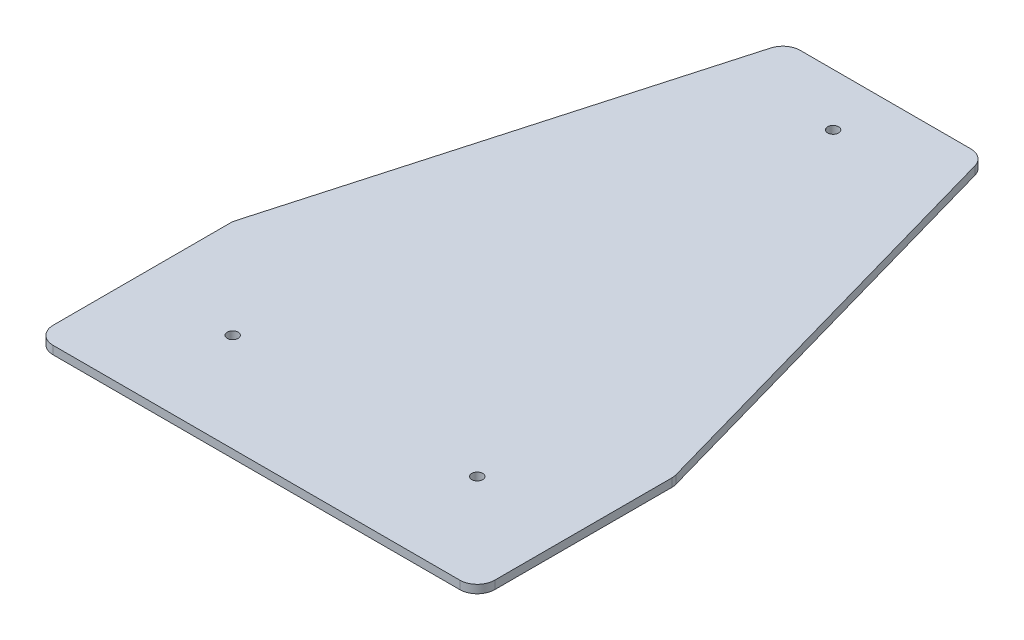
ISO-10303-21;
HEADER;
FILE_DESCRIPTION(('STEP AP214'),'2;1');
FILE_NAME('part.step','',(''),(''),'','','');
FILE_SCHEMA(('AUTOMOTIVE_DESIGN { 1 0 10303 214 1 1 1 1 }'));
ENDSEC;
DATA;
#1=APPLICATION_CONTEXT('core data for automotive mechanical design processes');
#2=APPLICATION_PROTOCOL_DEFINITION('international standard','automotive_design',2000,#1);
#3=PRODUCT_CONTEXT('',#1,'mechanical');
#4=PRODUCT('Part','Part','',(#3));
#5=PRODUCT_RELATED_PRODUCT_CATEGORY('part','',(#4));
#6=PRODUCT_DEFINITION_FORMATION('','',#4);
#7=PRODUCT_DEFINITION_CONTEXT('part definition',#1,'design');
#8=PRODUCT_DEFINITION('design','',#6,#7);
#9=PRODUCT_DEFINITION_SHAPE('','',#8);
#10=(LENGTH_UNIT() NAMED_UNIT(*) SI_UNIT(.MILLI.,.METRE.));
#11=(NAMED_UNIT(*) PLANE_ANGLE_UNIT() SI_UNIT($,.RADIAN.));
#12=(NAMED_UNIT(*) SI_UNIT($,.STERADIAN.) SOLID_ANGLE_UNIT());
#13=UNCERTAINTY_MEASURE_WITH_UNIT(LENGTH_MEASURE(1.E-05),#10,'distance_accuracy_value','');
#14=(GEOMETRIC_REPRESENTATION_CONTEXT(3) GLOBAL_UNCERTAINTY_ASSIGNED_CONTEXT((#13)) GLOBAL_UNIT_ASSIGNED_CONTEXT((#10,
#11,#12)) REPRESENTATION_CONTEXT('',''));
#15=CARTESIAN_POINT('',(0.,0.,0.));
#16=DIRECTION('',(0.,0.,1.));
#17=DIRECTION('',(1.,0.,0.));
#18=AXIS2_PLACEMENT_3D('',#15,#16,#17);
#19=CARTESIAN_POINT('',(28.18,2.36,-151.82));
#20=DIRECTION('',(-0.962190654316448,0.,0.27237684326331));
#21=DIRECTION('',(0.27237684326331,0.,0.962190654316448));
#22=AXIS2_PLACEMENT_3D('',#19,#20,#21);
#23=PLANE('',#22);
#24=DIRECTION('',(-0.27237684326331,0.,-0.962190654316448));
#25=VECTOR('',#24,1.);
#26=CARTESIAN_POINT('',(28.18,0.,-151.82));
#27=LINE('',#26,#25);
#28=CARTESIAN_POINT('',(62.9909532715822,0.,-28.8478210714734));
#29=VERTEX_POINT('',#28);
#30=CARTESIAN_POINT('',(29.2098774864843,0.,-148.181884216317));
#31=VERTEX_POINT('',#30);
#32=EDGE_CURVE('E216',#29,#31,#27,.T.);
#33=ORIENTED_EDGE('',*,*,#32,.T.);
#34=DIRECTION('',(0.,-1.,0.));
#35=VECTOR('',#34,1.);
#36=CARTESIAN_POINT('',(29.2098774864843,2.36,-148.181884216317));
#37=LINE('',#36,#35);
#38=CARTESIAN_POINT('',(29.2098774864843,2.36,-148.181884216317));
#39=VERTEX_POINT('',#38);
#40=EDGE_CURVE('E192',#31,#39,#37,.F.);
#41=ORIENTED_EDGE('',*,*,#40,.T.);
#42=DIRECTION('',(-0.27237684326331,0.,-0.962190654316448));
#43=VECTOR('',#42,1.);
#44=CARTESIAN_POINT('',(28.18,2.36,-151.82));
#45=LINE('',#44,#43);
#46=CARTESIAN_POINT('',(62.9909532715822,2.36,-28.8478210714734));
#47=VERTEX_POINT('',#46);
#48=EDGE_CURVE('E159',#47,#39,#45,.T.);
#49=ORIENTED_EDGE('',*,*,#48,.F.);
#50=DIRECTION('',(0.,-1.,0.));
#51=VECTOR('',#50,1.);
#52=CARTESIAN_POINT('',(62.9909532715822,2.36,-28.8478210714734));
#53=LINE('',#52,#51);
#54=EDGE_CURVE('E189',#47,#29,#53,.T.);
#55=ORIENTED_EDGE('',*,*,#54,.T.);
#56=EDGE_LOOP('',(#33,#41,#49,#55));
#57=FACE_BOUND('',#56,.T.);
#58=ADVANCED_FACE('F32',(#57),#23,.F.);
#59=CARTESIAN_POINT('',(-28.18,2.36,-151.82));
#60=DIRECTION('',(0.,0.,1.));
#61=DIRECTION('',(1.,0.,0.));
#62=AXIS2_PLACEMENT_3D('',#59,#60,#61);
#63=PLANE('',#62);
#64=DIRECTION('',(-1.,0.,0.));
#65=VECTOR('',#64,1.);
#66=CARTESIAN_POINT('',(-28.18,0.,-151.82));
#67=LINE('',#66,#65);
#68=CARTESIAN_POINT('',(24.398924214902,0.,-151.82));
#69=VERTEX_POINT('',#68);
#70=CARTESIAN_POINT('',(-24.3989242149021,0.,-151.82));
#71=VERTEX_POINT('',#70);
#72=EDGE_CURVE('E154',#69,#71,#67,.T.);
#73=ORIENTED_EDGE('',*,*,#72,.T.);
#74=DIRECTION('',(0.,-1.,0.));
#75=VECTOR('',#74,1.);
#76=CARTESIAN_POINT('',(-24.3989242149021,2.36,-151.82));
#77=LINE('',#76,#75);
#78=CARTESIAN_POINT('',(-24.3989242149021,2.36,-151.82));
#79=VERTEX_POINT('',#78);
#80=EDGE_CURVE('E187',#71,#79,#77,.F.);
#81=ORIENTED_EDGE('',*,*,#80,.T.);
#82=DIRECTION('',(-1.,0.,0.));
#83=VECTOR('',#82,1.);
#84=CARTESIAN_POINT('',(-28.18,2.36,-151.82));
#85=LINE('',#84,#83);
#86=CARTESIAN_POINT('',(24.398924214902,2.36,-151.82));
#87=VERTEX_POINT('',#86);
#88=EDGE_CURVE('E235',#87,#79,#85,.T.);
#89=ORIENTED_EDGE('',*,*,#88,.F.);
#90=DIRECTION('',(0.,-1.,0.));
#91=VECTOR('',#90,1.);
#92=CARTESIAN_POINT('',(24.3989242149021,2.36,-151.82));
#93=LINE('',#92,#91);
#94=EDGE_CURVE('E184',#87,#69,#93,.T.);
#95=ORIENTED_EDGE('',*,*,#94,.T.);
#96=EDGE_LOOP('',(#73,#81,#89,#95));
#97=FACE_BOUND('',#96,.T.);
#98=ADVANCED_FACE('F223',(#97),#63,.F.);
#99=CARTESIAN_POINT('',(-28.18,2.36,-151.82));
#100=DIRECTION('',(0.962190654316448,0.,0.27237684326331));
#101=DIRECTION('',(0.27237684326331,0.,-0.962190654316448));
#102=AXIS2_PLACEMENT_3D('',#99,#100,#101);
#103=PLANE('',#102);
#104=DIRECTION('',(-0.27237684326331,0.,0.962190654316448));
#105=VECTOR('',#104,1.);
#106=CARTESIAN_POINT('',(-28.18,0.,-151.82));
#107=LINE('',#106,#105);
#108=CARTESIAN_POINT('',(-29.2098774864843,0.,-148.181884216317));
#109=VERTEX_POINT('',#108);
#110=CARTESIAN_POINT('',(-62.9909532715823,0.,-28.8478210714734));
#111=VERTEX_POINT('',#110);
#112=EDGE_CURVE('E149',#109,#111,#107,.T.);
#113=ORIENTED_EDGE('',*,*,#112,.T.);
#114=DIRECTION('',(0.,-1.,0.));
#115=VECTOR('',#114,1.);
#116=CARTESIAN_POINT('',(-62.9909532715823,2.36,-28.8478210714734));
#117=LINE('',#116,#115);
#118=CARTESIAN_POINT('',(-62.9909532715823,2.36,-28.8478210714734));
#119=VERTEX_POINT('',#118);
#120=EDGE_CURVE('E127',#111,#119,#117,.F.);
#121=ORIENTED_EDGE('',*,*,#120,.T.);
#122=DIRECTION('',(-0.27237684326331,0.,0.962190654316448));
#123=VECTOR('',#122,1.);
#124=CARTESIAN_POINT('',(-28.18,2.36,-151.82));
#125=LINE('',#124,#123);
#126=CARTESIAN_POINT('',(-29.2098774864843,2.36,-148.181884216317));
#127=VERTEX_POINT('',#126);
#128=EDGE_CURVE('E234',#127,#119,#125,.T.);
#129=ORIENTED_EDGE('',*,*,#128,.F.);
#130=DIRECTION('',(0.,-1.,0.));
#131=VECTOR('',#130,1.);
#132=CARTESIAN_POINT('',(-29.2098774864843,2.36,-148.181884216317));
#133=LINE('',#132,#131);
#134=EDGE_CURVE('E132',#127,#109,#133,.T.);
#135=ORIENTED_EDGE('',*,*,#134,.T.);
#136=EDGE_LOOP('',(#113,#121,#129,#135));
#137=FACE_BOUND('',#136,.T.);
#138=ADVANCED_FACE('F237',(#137),#103,.F.);
#139=CARTESIAN_POINT('',(-63.18,2.36,28.18));
#140=DIRECTION('',(1.,0.,0.));
#141=DIRECTION('',(0.,0.,-1.));
#142=AXIS2_PLACEMENT_3D('',#139,#140,#141);
#143=PLANE('',#142);
#144=DIRECTION('',(0.,0.,1.));
#145=VECTOR('',#144,1.);
#146=CARTESIAN_POINT('',(-63.18,2.36,28.18));
#147=LINE('',#146,#145);
#148=CARTESIAN_POINT('',(-63.18,2.36,-27.4859368551569));
#149=VERTEX_POINT('',#148);
#150=CARTESIAN_POINT('',(-63.18,2.36,23.18));
#151=VERTEX_POINT('',#150);
#152=EDGE_CURVE('E142',#149,#151,#147,.T.);
#153=ORIENTED_EDGE('',*,*,#152,.F.);
#154=DIRECTION('',(0.,-1.,0.));
#155=VECTOR('',#154,1.);
#156=CARTESIAN_POINT('',(-63.18,2.36,-27.4859368551569));
#157=LINE('',#156,#155);
#158=CARTESIAN_POINT('',(-63.18,0.,-27.4859368551569));
#159=VERTEX_POINT('',#158);
#160=EDGE_CURVE('E126',#149,#159,#157,.T.);
#161=ORIENTED_EDGE('',*,*,#160,.T.);
#162=DIRECTION('',(0.,0.,1.));
#163=VECTOR('',#162,1.);
#164=CARTESIAN_POINT('',(-63.18,0.,28.18));
#165=LINE('',#164,#163);
#166=CARTESIAN_POINT('',(-63.18,0.,23.18));
#167=VERTEX_POINT('',#166);
#168=EDGE_CURVE('E139',#159,#167,#165,.T.);
#169=ORIENTED_EDGE('',*,*,#168,.T.);
#170=DIRECTION('',(0.,-1.,0.));
#171=VECTOR('',#170,1.);
#172=CARTESIAN_POINT('',(-63.18,2.36,23.18));
#173=LINE('',#172,#171);
#174=EDGE_CURVE('E144',#167,#151,#173,.F.);
#175=ORIENTED_EDGE('',*,*,#174,.T.);
#176=EDGE_LOOP('',(#153,#161,#169,#175));
#177=FACE_BOUND('',#176,.T.);
#178=ADVANCED_FACE('F138',(#177),#143,.F.);
#179=CARTESIAN_POINT('',(-63.18,2.36,28.18));
#180=DIRECTION('',(0.,0.,-1.));
#181=DIRECTION('',(-1.,0.,0.));
#182=AXIS2_PLACEMENT_3D('',#179,#180,#181);
#183=PLANE('',#182);
#184=DIRECTION('',(1.,0.,0.));
#185=VECTOR('',#184,1.);
#186=CARTESIAN_POINT('',(-63.18,0.,28.18));
#187=LINE('',#186,#185);
#188=CARTESIAN_POINT('',(-58.18,0.,28.18));
#189=VERTEX_POINT('',#188);
#190=CARTESIAN_POINT('',(58.18,0.,28.18));
#191=VERTEX_POINT('',#190);
#192=EDGE_CURVE('E148',#189,#191,#187,.T.);
#193=ORIENTED_EDGE('',*,*,#192,.T.);
#194=DIRECTION('',(0.,-1.,0.));
#195=VECTOR('',#194,1.);
#196=CARTESIAN_POINT('',(58.18,2.36,28.18));
#197=LINE('',#196,#195);
#198=CARTESIAN_POINT('',(58.18,2.36,28.18));
#199=VERTEX_POINT('',#198);
#200=EDGE_CURVE('E11',#191,#199,#197,.F.);
#201=ORIENTED_EDGE('',*,*,#200,.T.);
#202=DIRECTION('',(1.,0.,0.));
#203=VECTOR('',#202,1.);
#204=CARTESIAN_POINT('',(-63.18,2.36,28.18));
#205=LINE('',#204,#203);
#206=CARTESIAN_POINT('',(-58.18,2.36,28.18));
#207=VERTEX_POINT('',#206);
#208=EDGE_CURVE('E203',#207,#199,#205,.T.);
#209=ORIENTED_EDGE('',*,*,#208,.F.);
#210=DIRECTION('',(0.,-1.,0.));
#211=VECTOR('',#210,1.);
#212=CARTESIAN_POINT('',(-58.18,2.36,28.18));
#213=LINE('',#212,#211);
#214=EDGE_CURVE('E40',#207,#189,#213,.T.);
#215=ORIENTED_EDGE('',*,*,#214,.T.);
#216=EDGE_LOOP('',(#193,#201,#209,#215));
#217=FACE_BOUND('',#216,.T.);
#218=ADVANCED_FACE('F201',(#217),#183,.F.);
#219=CARTESIAN_POINT('',(63.18,2.36,28.18));
#220=DIRECTION('',(-1.,0.,0.));
#221=DIRECTION('',(0.,0.,1.));
#222=AXIS2_PLACEMENT_3D('',#219,#220,#221);
#223=PLANE('',#222);
#224=DIRECTION('',(0.,0.,-1.));
#225=VECTOR('',#224,1.);
#226=CARTESIAN_POINT('',(63.18,0.,28.18));
#227=LINE('',#226,#225);
#228=CARTESIAN_POINT('',(63.18,0.,23.18));
#229=VERTEX_POINT('',#228);
#230=CARTESIAN_POINT('',(63.18,0.,-27.4859368551569));
#231=VERTEX_POINT('',#230);
#232=EDGE_CURVE('E152',#229,#231,#227,.T.);
#233=ORIENTED_EDGE('',*,*,#232,.T.);
#234=DIRECTION('',(0.,-1.,0.));
#235=VECTOR('',#234,1.);
#236=CARTESIAN_POINT('',(63.18,2.36,-27.4859368551569));
#237=LINE('',#236,#235);
#238=CARTESIAN_POINT('',(63.18,2.36,-27.4859368551569));
#239=VERTEX_POINT('',#238);
#240=EDGE_CURVE('E47',#231,#239,#237,.F.);
#241=ORIENTED_EDGE('',*,*,#240,.T.);
#242=DIRECTION('',(0.,0.,-1.));
#243=VECTOR('',#242,1.);
#244=CARTESIAN_POINT('',(63.18,2.36,28.18));
#245=LINE('',#244,#243);
#246=CARTESIAN_POINT('',(63.18,2.36,23.18));
#247=VERTEX_POINT('',#246);
#248=EDGE_CURVE('E160',#247,#239,#245,.T.);
#249=ORIENTED_EDGE('',*,*,#248,.F.);
#250=DIRECTION('',(0.,-1.,0.));
#251=VECTOR('',#250,1.);
#252=CARTESIAN_POINT('',(63.18,2.36,23.18));
#253=LINE('',#252,#251);
#254=EDGE_CURVE('E194',#247,#229,#253,.T.);
#255=ORIENTED_EDGE('',*,*,#254,.T.);
#256=EDGE_LOOP('',(#233,#241,#249,#255));
#257=FACE_BOUND('',#256,.T.);
#258=ADVANCED_FACE('F210',(#257),#223,.F.);
#259=CARTESIAN_POINT('',(0.,2.36,0.));
#260=DIRECTION('',(0.,1.,0.));
#261=DIRECTION('',(0.,0.,1.));
#262=AXIS2_PLACEMENT_3D('',#259,#260,#261);
#263=PLANE('',#262);
#264=CARTESIAN_POINT('',(0.,2.36,-136.82));
#265=DIRECTION('',(0.,1.,0.));
#266=DIRECTION('',(0.,0.,1.));
#267=AXIS2_PLACEMENT_3D('',#264,#265,#266);
#268=CIRCLE('',#267,1.5625);
#269=CARTESIAN_POINT('',(0.,2.36,-135.2575));
#270=VERTEX_POINT('',#269);
#271=EDGE_CURVE('E255',#270,#270,#268,.T.);
#272=ORIENTED_EDGE('',*,*,#271,.F.);
#273=EDGE_LOOP('',(#272));
#274=FACE_BOUND('',#273,.T.);
#275=CARTESIAN_POINT('',(35.,2.36,0.));
#276=DIRECTION('',(0.,1.,0.));
#277=DIRECTION('',(0.,0.,1.));
#278=AXIS2_PLACEMENT_3D('',#275,#276,#277);
#279=CIRCLE('',#278,1.5625);
#280=CARTESIAN_POINT('',(35.,2.36,1.56250000000001));
#281=VERTEX_POINT('',#280);
#282=EDGE_CURVE('E249',#281,#281,#279,.T.);
#283=ORIENTED_EDGE('',*,*,#282,.F.);
#284=EDGE_LOOP('',(#283));
#285=FACE_BOUND('',#284,.T.);
#286=CARTESIAN_POINT('',(-35.,2.36,0.));
#287=DIRECTION('',(0.,1.,0.));
#288=DIRECTION('',(0.,0.,1.));
#289=AXIS2_PLACEMENT_3D('',#286,#287,#288);
#290=CIRCLE('',#289,1.5625);
#291=CARTESIAN_POINT('',(-35.,2.36,1.56250000000001));
#292=VERTEX_POINT('',#291);
#293=EDGE_CURVE('E243',#292,#292,#290,.T.);
#294=ORIENTED_EDGE('',*,*,#293,.F.);
#295=EDGE_LOOP('',(#294));
#296=FACE_BOUND('',#295,.T.);
#297=ORIENTED_EDGE('',*,*,#128,.T.);
#298=CARTESIAN_POINT('',(-58.18,2.36,-27.4859368551569));
#299=DIRECTION('',(0.,1.,0.));
#300=DIRECTION('',(0.,0.,1.));
#301=AXIS2_PLACEMENT_3D('',#298,#299,#300);
#302=CIRCLE('',#301,5.);
#303=EDGE_CURVE('E182',#119,#149,#302,.T.);
#304=ORIENTED_EDGE('',*,*,#303,.T.);
#305=ORIENTED_EDGE('',*,*,#152,.T.);
#306=CARTESIAN_POINT('',(-58.18,2.36,23.18));
#307=DIRECTION('',(0.,1.,0.));
#308=DIRECTION('',(0.,0.,1.));
#309=AXIS2_PLACEMENT_3D('',#306,#307,#308);
#310=CIRCLE('',#309,5.);
#311=EDGE_CURVE('E173',#151,#207,#310,.T.);
#312=ORIENTED_EDGE('',*,*,#311,.T.);
#313=ORIENTED_EDGE('',*,*,#208,.T.);
#314=CARTESIAN_POINT('',(58.18,2.36,23.18));
#315=DIRECTION('',(0.,1.,0.));
#316=DIRECTION('',(0.,0.,1.));
#317=AXIS2_PLACEMENT_3D('',#314,#315,#316);
#318=CIRCLE('',#317,5.);
#319=EDGE_CURVE('E54',#199,#247,#318,.T.);
#320=ORIENTED_EDGE('',*,*,#319,.T.);
#321=ORIENTED_EDGE('',*,*,#248,.T.);
#322=CARTESIAN_POINT('',(58.18,2.36,-27.4859368551569));
#323=DIRECTION('',(0.,1.,0.));
#324=DIRECTION('',(0.,0.,1.));
#325=AXIS2_PLACEMENT_3D('',#322,#323,#324);
#326=CIRCLE('',#325,5.);
#327=EDGE_CURVE('E176',#239,#47,#326,.T.);
#328=ORIENTED_EDGE('',*,*,#327,.T.);
#329=ORIENTED_EDGE('',*,*,#48,.T.);
#330=CARTESIAN_POINT('',(24.3989242149021,2.36,-146.82));
#331=DIRECTION('',(0.,1.,0.));
#332=DIRECTION('',(0.,0.,1.));
#333=AXIS2_PLACEMENT_3D('',#330,#331,#332);
#334=CIRCLE('',#333,5.);
#335=EDGE_CURVE('E178',#39,#87,#334,.T.);
#336=ORIENTED_EDGE('',*,*,#335,.T.);
#337=ORIENTED_EDGE('',*,*,#88,.T.);
#338=CARTESIAN_POINT('',(-24.3989242149021,2.36,-146.82));
#339=DIRECTION('',(0.,1.,0.));
#340=DIRECTION('',(0.,0.,1.));
#341=AXIS2_PLACEMENT_3D('',#338,#339,#340);
#342=CIRCLE('',#341,5.);
#343=EDGE_CURVE('E180',#79,#127,#342,.T.);
#344=ORIENTED_EDGE('',*,*,#343,.T.);
#345=EDGE_LOOP('',(#297,#304,#305,#312,#313,#320,#321,#328,#329,#336,#337,#344));
#346=FACE_BOUND('',#345,.T.);
#347=ADVANCED_FACE('F233',(#274,#285,#296,#346),#263,.T.);
#348=CARTESIAN_POINT('',(0.,0.,0.));
#349=DIRECTION('',(0.,1.,0.));
#350=DIRECTION('',(0.,0.,1.));
#351=AXIS2_PLACEMENT_3D('',#348,#349,#350);
#352=PLANE('',#351);
#353=CARTESIAN_POINT('',(0.,0.,-136.82));
#354=DIRECTION('',(0.,1.,0.));
#355=DIRECTION('',(0.,0.,1.));
#356=AXIS2_PLACEMENT_3D('',#353,#354,#355);
#357=CIRCLE('',#356,1.5625);
#358=CARTESIAN_POINT('',(0.,0.,-135.2575));
#359=VERTEX_POINT('',#358);
#360=EDGE_CURVE('E252',#359,#359,#357,.T.);
#361=ORIENTED_EDGE('',*,*,#360,.T.);
#362=EDGE_LOOP('',(#361));
#363=FACE_BOUND('',#362,.T.);
#364=CARTESIAN_POINT('',(35.,0.,0.));
#365=DIRECTION('',(0.,1.,0.));
#366=DIRECTION('',(0.,0.,1.));
#367=AXIS2_PLACEMENT_3D('',#364,#365,#366);
#368=CIRCLE('',#367,1.5625);
#369=CARTESIAN_POINT('',(35.,0.,1.56250000000001));
#370=VERTEX_POINT('',#369);
#371=EDGE_CURVE('E246',#370,#370,#368,.T.);
#372=ORIENTED_EDGE('',*,*,#371,.T.);
#373=EDGE_LOOP('',(#372));
#374=FACE_BOUND('',#373,.T.);
#375=CARTESIAN_POINT('',(-35.,0.,0.));
#376=DIRECTION('',(0.,1.,0.));
#377=DIRECTION('',(0.,0.,1.));
#378=AXIS2_PLACEMENT_3D('',#375,#376,#377);
#379=CIRCLE('',#378,1.5625);
#380=CARTESIAN_POINT('',(-35.,0.,1.56250000000001));
#381=VERTEX_POINT('',#380);
#382=EDGE_CURVE('E218',#381,#381,#379,.T.);
#383=ORIENTED_EDGE('',*,*,#382,.T.);
#384=EDGE_LOOP('',(#383));
#385=FACE_BOUND('',#384,.T.);
#386=ORIENTED_EDGE('',*,*,#168,.F.);
#387=CARTESIAN_POINT('',(-58.18,0.,-27.4859368551569));
#388=DIRECTION('',(0.,1.,0.));
#389=DIRECTION('',(0.,0.,1.));
#390=AXIS2_PLACEMENT_3D('',#387,#388,#389);
#391=CIRCLE('',#390,5.);
#392=EDGE_CURVE('E122',#159,#111,#391,.F.);
#393=ORIENTED_EDGE('',*,*,#392,.T.);
#394=ORIENTED_EDGE('',*,*,#112,.F.);
#395=CARTESIAN_POINT('',(-24.3989242149021,0.,-146.82));
#396=DIRECTION('',(0.,1.,0.));
#397=DIRECTION('',(0.,0.,1.));
#398=AXIS2_PLACEMENT_3D('',#395,#396,#397);
#399=CIRCLE('',#398,5.);
#400=EDGE_CURVE('E133',#109,#71,#399,.F.);
#401=ORIENTED_EDGE('',*,*,#400,.T.);
#402=ORIENTED_EDGE('',*,*,#72,.F.);
#403=CARTESIAN_POINT('',(24.3989242149021,0.,-146.82));
#404=DIRECTION('',(0.,1.,0.));
#405=DIRECTION('',(0.,0.,1.));
#406=AXIS2_PLACEMENT_3D('',#403,#404,#405);
#407=CIRCLE('',#406,5.);
#408=EDGE_CURVE('E167',#69,#31,#407,.F.);
#409=ORIENTED_EDGE('',*,*,#408,.T.);
#410=ORIENTED_EDGE('',*,*,#32,.F.);
#411=CARTESIAN_POINT('',(58.18,0.,-27.4859368551569));
#412=DIRECTION('',(0.,1.,0.));
#413=DIRECTION('',(0.,0.,1.));
#414=AXIS2_PLACEMENT_3D('',#411,#412,#413);
#415=CIRCLE('',#414,5.);
#416=EDGE_CURVE('E165',#29,#231,#415,.F.);
#417=ORIENTED_EDGE('',*,*,#416,.T.);
#418=ORIENTED_EDGE('',*,*,#232,.F.);
#419=CARTESIAN_POINT('',(58.18,0.,23.18));
#420=DIRECTION('',(0.,1.,0.));
#421=DIRECTION('',(0.,0.,1.));
#422=AXIS2_PLACEMENT_3D('',#419,#420,#421);
#423=CIRCLE('',#422,5.);
#424=EDGE_CURVE('E163',#229,#191,#423,.F.);
#425=ORIENTED_EDGE('',*,*,#424,.T.);
#426=ORIENTED_EDGE('',*,*,#192,.F.);
#427=CARTESIAN_POINT('',(-58.18,0.,23.18));
#428=DIRECTION('',(0.,1.,0.));
#429=DIRECTION('',(0.,0.,1.));
#430=AXIS2_PLACEMENT_3D('',#427,#428,#429);
#431=CIRCLE('',#430,5.);
#432=EDGE_CURVE('E143',#189,#167,#431,.F.);
#433=ORIENTED_EDGE('',*,*,#432,.T.);
#434=EDGE_LOOP('',(#386,#393,#394,#401,#402,#409,#410,#417,#418,#425,#426,#433));
#435=FACE_BOUND('',#434,.T.);
#436=ADVANCED_FACE('F146',(#363,#374,#385,#435),#352,.F.);
#437=CARTESIAN_POINT('',(-58.18,2.36,-27.4859368551569));
#438=DIRECTION('',(0.,-1.,0.));
#439=DIRECTION('',(0.,0.,-1.));
#440=AXIS2_PLACEMENT_3D('',#437,#438,#439);
#441=CYLINDRICAL_SURFACE('',#440,5.);
#442=ORIENTED_EDGE('',*,*,#303,.F.);
#443=ORIENTED_EDGE('',*,*,#120,.F.);
#444=ORIENTED_EDGE('',*,*,#392,.F.);
#445=ORIENTED_EDGE('',*,*,#160,.F.);
#446=EDGE_LOOP('',(#442,#443,#444,#445));
#447=FACE_BOUND('',#446,.T.);
#448=ADVANCED_FACE('F125',(#447),#441,.T.);
#449=CARTESIAN_POINT('',(-24.3989242149021,2.36,-146.82));
#450=DIRECTION('',(0.,-1.,0.));
#451=DIRECTION('',(0.,0.,-1.));
#452=AXIS2_PLACEMENT_3D('',#449,#450,#451);
#453=CYLINDRICAL_SURFACE('',#452,5.);
#454=ORIENTED_EDGE('',*,*,#343,.F.);
#455=ORIENTED_EDGE('',*,*,#80,.F.);
#456=ORIENTED_EDGE('',*,*,#400,.F.);
#457=ORIENTED_EDGE('',*,*,#134,.F.);
#458=EDGE_LOOP('',(#454,#455,#456,#457));
#459=FACE_BOUND('',#458,.T.);
#460=ADVANCED_FACE('F229',(#459),#453,.T.);
#461=CARTESIAN_POINT('',(24.3989242149021,2.36,-146.82));
#462=DIRECTION('',(0.,-1.,0.));
#463=DIRECTION('',(0.,0.,-1.));
#464=AXIS2_PLACEMENT_3D('',#461,#462,#463);
#465=CYLINDRICAL_SURFACE('',#464,5.);
#466=ORIENTED_EDGE('',*,*,#335,.F.);
#467=ORIENTED_EDGE('',*,*,#40,.F.);
#468=ORIENTED_EDGE('',*,*,#408,.F.);
#469=ORIENTED_EDGE('',*,*,#94,.F.);
#470=EDGE_LOOP('',(#466,#467,#468,#469));
#471=FACE_BOUND('',#470,.T.);
#472=ADVANCED_FACE('F301',(#471),#465,.T.);
#473=CARTESIAN_POINT('',(58.18,2.36,-27.4859368551569));
#474=DIRECTION('',(0.,-1.,0.));
#475=DIRECTION('',(0.,0.,-1.));
#476=AXIS2_PLACEMENT_3D('',#473,#474,#475);
#477=CYLINDRICAL_SURFACE('',#476,5.);
#478=ORIENTED_EDGE('',*,*,#327,.F.);
#479=ORIENTED_EDGE('',*,*,#240,.F.);
#480=ORIENTED_EDGE('',*,*,#416,.F.);
#481=ORIENTED_EDGE('',*,*,#54,.F.);
#482=EDGE_LOOP('',(#478,#479,#480,#481));
#483=FACE_BOUND('',#482,.T.);
#484=ADVANCED_FACE('F304',(#483),#477,.T.);
#485=CARTESIAN_POINT('',(58.18,2.36,23.18));
#486=DIRECTION('',(0.,-1.,0.));
#487=DIRECTION('',(0.,0.,-1.));
#488=AXIS2_PLACEMENT_3D('',#485,#486,#487);
#489=CYLINDRICAL_SURFACE('',#488,5.);
#490=ORIENTED_EDGE('',*,*,#319,.F.);
#491=ORIENTED_EDGE('',*,*,#200,.F.);
#492=ORIENTED_EDGE('',*,*,#424,.F.);
#493=ORIENTED_EDGE('',*,*,#254,.F.);
#494=EDGE_LOOP('',(#490,#491,#492,#493));
#495=FACE_BOUND('',#494,.T.);
#496=ADVANCED_FACE('F209',(#495),#489,.T.);
#497=CARTESIAN_POINT('',(-58.18,2.36,23.18));
#498=DIRECTION('',(0.,-1.,0.));
#499=DIRECTION('',(0.,0.,-1.));
#500=AXIS2_PLACEMENT_3D('',#497,#498,#499);
#501=CYLINDRICAL_SURFACE('',#500,5.);
#502=ORIENTED_EDGE('',*,*,#311,.F.);
#503=ORIENTED_EDGE('',*,*,#174,.F.);
#504=ORIENTED_EDGE('',*,*,#432,.F.);
#505=ORIENTED_EDGE('',*,*,#214,.F.);
#506=EDGE_LOOP('',(#502,#503,#504,#505));
#507=FACE_BOUND('',#506,.T.);
#508=ADVANCED_FACE('F34',(#507),#501,.T.);
#509=CARTESIAN_POINT('',(-35.,0.,0.));
#510=DIRECTION('',(0.,1.,0.));
#511=DIRECTION('',(0.,0.,1.));
#512=AXIS2_PLACEMENT_3D('',#509,#510,#511);
#513=CYLINDRICAL_SURFACE('',#512,1.5625);
#514=ORIENTED_EDGE('',*,*,#382,.F.);
#515=EDGE_LOOP('',(#514));
#516=FACE_BOUND('',#515,.T.);
#517=ORIENTED_EDGE('',*,*,#293,.T.);
#518=EDGE_LOOP('',(#517));
#519=FACE_BOUND('',#518,.T.);
#520=ADVANCED_FACE('F277',(#516,#519),#513,.F.);
#521=CARTESIAN_POINT('',(35.,0.,0.));
#522=DIRECTION('',(0.,1.,0.));
#523=DIRECTION('',(0.,0.,1.));
#524=AXIS2_PLACEMENT_3D('',#521,#522,#523);
#525=CYLINDRICAL_SURFACE('',#524,1.5625);
#526=ORIENTED_EDGE('',*,*,#371,.F.);
#527=EDGE_LOOP('',(#526));
#528=FACE_BOUND('',#527,.T.);
#529=ORIENTED_EDGE('',*,*,#282,.T.);
#530=EDGE_LOOP('',(#529));
#531=FACE_BOUND('',#530,.T.);
#532=ADVANCED_FACE('F266',(#528,#531),#525,.F.);
#533=CARTESIAN_POINT('',(0.,0.,-136.82));
#534=DIRECTION('',(0.,1.,0.));
#535=DIRECTION('',(0.,0.,1.));
#536=AXIS2_PLACEMENT_3D('',#533,#534,#535);
#537=CYLINDRICAL_SURFACE('',#536,1.5625);
#538=ORIENTED_EDGE('',*,*,#360,.F.);
#539=EDGE_LOOP('',(#538));
#540=FACE_BOUND('',#539,.T.);
#541=ORIENTED_EDGE('',*,*,#271,.T.);
#542=EDGE_LOOP('',(#541));
#543=FACE_BOUND('',#542,.T.);
#544=ADVANCED_FACE('F263',(#540,#543),#537,.F.);
#545=CLOSED_SHELL('',(#58,#98,#138,#178,#218,#258,#347,#436,#448,#460,#472,#484,#496,#508,#520,
#532,#544));
#546=MANIFOLD_SOLID_BREP('B2',#545);
#547=ADVANCED_BREP_SHAPE_REPRESENTATION('',(#18,#546),#14);
#548=SHAPE_DEFINITION_REPRESENTATION(#9,#547);
ENDSEC;
END-ISO-10303-21;
